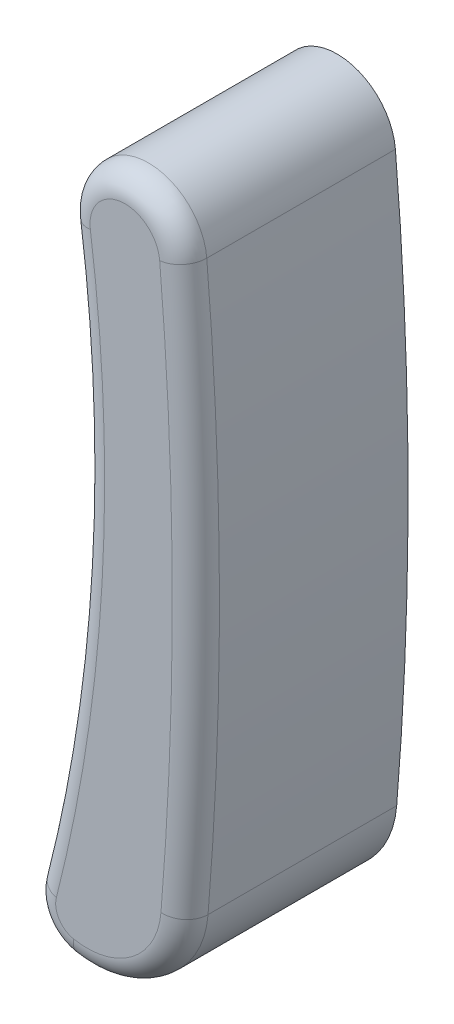
ISO-10303-21;
HEADER;
FILE_DESCRIPTION(('STEP AP214'),'2;1');
FILE_NAME('part.step','',(''),(''),'','','');
FILE_SCHEMA(('AUTOMOTIVE_DESIGN { 1 0 10303 214 1 1 1 1 }'));
ENDSEC;
DATA;
#1=APPLICATION_CONTEXT('core data for automotive mechanical design processes');
#2=APPLICATION_PROTOCOL_DEFINITION('international standard','automotive_design',2000,#1);
#3=PRODUCT_CONTEXT('',#1,'mechanical');
#4=PRODUCT('Part','Part','',(#3));
#5=PRODUCT_RELATED_PRODUCT_CATEGORY('part','',(#4));
#6=PRODUCT_DEFINITION_FORMATION('','',#4);
#7=PRODUCT_DEFINITION_CONTEXT('part definition',#1,'design');
#8=PRODUCT_DEFINITION('design','',#6,#7);
#9=PRODUCT_DEFINITION_SHAPE('','',#8);
#10=(LENGTH_UNIT() NAMED_UNIT(*) SI_UNIT(.MILLI.,.METRE.));
#11=(NAMED_UNIT(*) PLANE_ANGLE_UNIT() SI_UNIT($,.RADIAN.));
#12=(NAMED_UNIT(*) SI_UNIT($,.STERADIAN.) SOLID_ANGLE_UNIT());
#13=UNCERTAINTY_MEASURE_WITH_UNIT(LENGTH_MEASURE(1.E-05),#10,'distance_accuracy_value','');
#14=(GEOMETRIC_REPRESENTATION_CONTEXT(3) GLOBAL_UNCERTAINTY_ASSIGNED_CONTEXT((#13)) GLOBAL_UNIT_ASSIGNED_CONTEXT((#10,
#11,#12)) REPRESENTATION_CONTEXT('',''));
#15=CARTESIAN_POINT('',(0.,0.,0.));
#16=DIRECTION('',(0.,0.,1.));
#17=DIRECTION('',(1.,0.,0.));
#18=AXIS2_PLACEMENT_3D('',#15,#16,#17);
#19=CARTESIAN_POINT('',(-69.4737555962124,0.222065170422888,4.5));
#20=DIRECTION('',(0.,0.,-1.));
#21=DIRECTION('',(-1.,0.,0.));
#22=AXIS2_PLACEMENT_3D('',#19,#20,#21);
#23=CYLINDRICAL_SURFACE('',#22,71.2102253998222);
#24=DIRECTION('',(0.,0.,-1.));
#25=VECTOR('',#24,1.);
#26=CARTESIAN_POINT('',(1.46761875852094,6.40410416698838,4.5));
#27=LINE('',#26,#25);
#28=CARTESIAN_POINT('',(1.46761875852094,6.40410416698838,4.));
#29=VERTEX_POINT('',#28);
#30=CARTESIAN_POINT('',(1.46761875852094,6.40410416698838,0.));
#31=VERTEX_POINT('',#30);
#32=EDGE_CURVE('E100',#29,#31,#27,.T.);
#33=ORIENTED_EDGE('',*,*,#32,.F.);
#34=CARTESIAN_POINT('',(-69.4737555962124,0.222065170422888,4.));
#35=DIRECTION('',(0.,0.,1.));
#36=DIRECTION('',(1.,0.,0.));
#37=AXIS2_PLACEMENT_3D('',#34,#35,#36);
#38=CIRCLE('',#37,71.2102253998222);
#39=CARTESIAN_POINT('',(1.49502237075019,-5.63700944673482,4.));
#40=VERTEX_POINT('',#39);
#41=EDGE_CURVE('E11',#29,#40,#38,.F.);
#42=ORIENTED_EDGE('',*,*,#41,.T.);
#43=DIRECTION('',(0.,0.,-1.));
#44=VECTOR('',#43,1.);
#45=CARTESIAN_POINT('',(1.49502237075019,-5.63700944673482,4.5));
#46=LINE('',#45,#44);
#47=CARTESIAN_POINT('',(1.49502237075019,-5.63700944673482,0.));
#48=VERTEX_POINT('',#47);
#49=EDGE_CURVE('E121',#40,#48,#46,.T.);
#50=ORIENTED_EDGE('',*,*,#49,.T.);
#51=CARTESIAN_POINT('',(-69.4737555962124,0.222065170422888,0.));
#52=DIRECTION('',(0.,0.,1.));
#53=DIRECTION('',(1.,0.,0.));
#54=AXIS2_PLACEMENT_3D('',#51,#52,#53);
#55=CIRCLE('',#54,71.2102253998222);
#56=EDGE_CURVE('E115',#48,#31,#55,.T.);
#57=ORIENTED_EDGE('',*,*,#56,.T.);
#58=EDGE_LOOP('',(#33,#42,#50,#57));
#59=FACE_BOUND('',#58,.T.);
#60=ADVANCED_FACE('F39',(#59),#23,.T.);
#61=CARTESIAN_POINT('',(0.232087765483922,6.29643638003197,4.5));
#62=DIRECTION('',(0.,0.,-1.));
#63=DIRECTION('',(-1.,0.,0.));
#64=AXIS2_PLACEMENT_3D('',#61,#62,#63);
#65=CYLINDRICAL_SURFACE('',#64,1.24021336353997);
#66=DIRECTION('',(0.,0.,-1.));
#67=VECTOR('',#66,1.);
#68=CARTESIAN_POINT('',(-0.996737871420484,6.12875590654262,4.5));
#69=LINE('',#68,#67);
#70=CARTESIAN_POINT('',(-0.996737871420484,6.12875590654262,4.));
#71=VERTEX_POINT('',#70);
#72=CARTESIAN_POINT('',(-0.996737871420484,6.12875590654262,0.));
#73=VERTEX_POINT('',#72);
#74=EDGE_CURVE('E109',#71,#73,#69,.T.);
#75=ORIENTED_EDGE('',*,*,#74,.F.);
#76=CARTESIAN_POINT('',(0.232087765483922,6.29643638003197,4.));
#77=DIRECTION('',(0.,0.,1.));
#78=DIRECTION('',(1.,0.,0.));
#79=AXIS2_PLACEMENT_3D('',#76,#77,#78);
#80=CIRCLE('',#79,1.24021336353997);
#81=EDGE_CURVE('E48',#71,#29,#80,.F.);
#82=ORIENTED_EDGE('',*,*,#81,.T.);
#83=ORIENTED_EDGE('',*,*,#32,.T.);
#84=CARTESIAN_POINT('',(0.232087765483922,6.29643638003197,0.));
#85=DIRECTION('',(0.,0.,1.));
#86=DIRECTION('',(1.,0.,0.));
#87=AXIS2_PLACEMENT_3D('',#84,#85,#86);
#88=CIRCLE('',#87,1.24021336353997);
#89=EDGE_CURVE('E103',#31,#73,#88,.T.);
#90=ORIENTED_EDGE('',*,*,#89,.T.);
#91=EDGE_LOOP('',(#75,#82,#83,#90));
#92=FACE_BOUND('',#91,.T.);
#93=ADVANCED_FACE('F102',(#92),#65,.T.);
#94=CARTESIAN_POINT('',(-33.2472226070941,1.72798789811171,4.5));
#95=DIRECTION('',(0.,0.,-1.));
#96=DIRECTION('',(-1.,0.,0.));
#97=AXIS2_PLACEMENT_3D('',#94,#95,#96);
#98=CYLINDRICAL_SURFACE('',#97,32.5493552125069);
#99=DIRECTION('',(0.,0.,-1.));
#100=VECTOR('',#99,1.);
#101=CARTESIAN_POINT('',(-1.70650206276595,-6.31212853727334,4.5));
#102=LINE('',#101,#100);
#103=CARTESIAN_POINT('',(-1.70650206276595,-6.31212853727334,4.));
#104=VERTEX_POINT('',#103);
#105=CARTESIAN_POINT('',(-1.70650206276595,-6.31212853727334,0.));
#106=VERTEX_POINT('',#105);
#107=EDGE_CURVE('E136',#104,#106,#102,.T.);
#108=ORIENTED_EDGE('',*,*,#107,.F.);
#109=CARTESIAN_POINT('',(-33.2472226070941,1.72798789811171,4.));
#110=DIRECTION('',(0.,0.,1.));
#111=DIRECTION('',(1.,0.,0.));
#112=AXIS2_PLACEMENT_3D('',#109,#110,#111);
#113=CIRCLE('',#112,32.5493552125069);
#114=EDGE_CURVE('E63',#104,#71,#113,.T.);
#115=ORIENTED_EDGE('',*,*,#114,.T.);
#116=ORIENTED_EDGE('',*,*,#74,.T.);
#117=CARTESIAN_POINT('',(-33.2472226070941,1.72798789811171,0.));
#118=DIRECTION('',(0.,0.,-1.));
#119=DIRECTION('',(1.,0.,0.));
#120=AXIS2_PLACEMENT_3D('',#117,#118,#119);
#121=CIRCLE('',#120,32.5493552125069);
#122=EDGE_CURVE('E118',#73,#106,#121,.T.);
#123=ORIENTED_EDGE('',*,*,#122,.T.);
#124=EDGE_LOOP('',(#108,#115,#116,#123));
#125=FACE_BOUND('',#124,.T.);
#126=ADVANCED_FACE('F204',(#125),#98,.F.);
#127=CARTESIAN_POINT('',(-0.769389578810673,-6.55101000079193,4.5));
#128=DIRECTION('',(0.,0.,-1.));
#129=DIRECTION('',(-1.,0.,0.));
#130=AXIS2_PLACEMENT_3D('',#127,#128,#129);
#131=CYLINDRICAL_SURFACE('',#130,0.967080224799222);
#132=DIRECTION('',(0.,0.,-1.));
#133=VECTOR('',#132,1.);
#134=CARTESIAN_POINT('',(-0.946059772700119,-7.50181587150833,4.5));
#135=LINE('',#134,#133);
#136=CARTESIAN_POINT('',(-0.946059772700119,-7.50181587150833,4.));
#137=VERTEX_POINT('',#136);
#138=CARTESIAN_POINT('',(-0.946059772700119,-7.50181587150833,0.));
#139=VERTEX_POINT('',#138);
#140=EDGE_CURVE('E134',#137,#139,#135,.T.);
#141=ORIENTED_EDGE('',*,*,#140,.F.);
#142=CARTESIAN_POINT('',(-0.769389578810673,-6.55101000079193,4.));
#143=DIRECTION('',(0.,0.,1.));
#144=DIRECTION('',(1.,0.,0.));
#145=AXIS2_PLACEMENT_3D('',#142,#143,#144);
#146=CIRCLE('',#145,0.967080224799222);
#147=EDGE_CURVE('E152',#137,#104,#146,.F.);
#148=ORIENTED_EDGE('',*,*,#147,.T.);
#149=ORIENTED_EDGE('',*,*,#107,.T.);
#150=CARTESIAN_POINT('',(-0.769389578810673,-6.55101000079193,0.));
#151=DIRECTION('',(0.,0.,1.));
#152=DIRECTION('',(1.,0.,0.));
#153=AXIS2_PLACEMENT_3D('',#150,#151,#152);
#154=CIRCLE('',#153,0.967080224799222);
#155=EDGE_CURVE('E128',#106,#139,#154,.T.);
#156=ORIENTED_EDGE('',*,*,#155,.T.);
#157=EDGE_LOOP('',(#141,#148,#149,#156));
#158=FACE_BOUND('',#157,.T.);
#159=ADVANCED_FACE('F197',(#158),#131,.T.);
#160=CARTESIAN_POINT('',(-0.567912234516366,-5.46669669613084,4.5));
#161=DIRECTION('',(0.,0.,-1.));
#162=DIRECTION('',(-1.,0.,0.));
#163=AXIS2_PLACEMENT_3D('',#160,#161,#162);
#164=CYLINDRICAL_SURFACE('',#163,2.06995304744445);
#165=ORIENTED_EDGE('',*,*,#49,.F.);
#166=CARTESIAN_POINT('',(-0.567912234516366,-5.46669669613084,4.));
#167=DIRECTION('',(0.,0.,1.));
#168=DIRECTION('',(1.,0.,0.));
#169=AXIS2_PLACEMENT_3D('',#166,#167,#168);
#170=CIRCLE('',#169,2.06995304744445);
#171=EDGE_CURVE('E149',#40,#137,#170,.F.);
#172=ORIENTED_EDGE('',*,*,#171,.T.);
#173=ORIENTED_EDGE('',*,*,#140,.T.);
#174=CARTESIAN_POINT('',(-0.567912234516366,-5.46669669613084,0.));
#175=DIRECTION('',(0.,0.,1.));
#176=DIRECTION('',(1.,0.,0.));
#177=AXIS2_PLACEMENT_3D('',#174,#175,#176);
#178=CIRCLE('',#177,2.06995304744445);
#179=EDGE_CURVE('E131',#139,#48,#178,.T.);
#180=ORIENTED_EDGE('',*,*,#179,.T.);
#181=EDGE_LOOP('',(#165,#172,#173,#180));
#182=FACE_BOUND('',#181,.T.);
#183=ADVANCED_FACE('F182',(#182),#164,.T.);
#184=CARTESIAN_POINT('',(-34.6208339153643,3.25925077522743,4.5));
#185=DIRECTION('',(0.,0.,1.));
#186=DIRECTION('',(1.,0.,0.));
#187=AXIS2_PLACEMENT_3D('',#184,#185,#186);
#188=PLANE('',#187);
#189=CARTESIAN_POINT('',(-0.769389578810673,-6.55101000079193,4.5));
#190=DIRECTION('',(0.,0.,1.));
#191=DIRECTION('',(1.,0.,0.));
#192=AXIS2_PLACEMENT_3D('',#189,#190,#191);
#193=CIRCLE('',#192,0.467080224799222);
#194=CARTESIAN_POINT('',(-1.22199598978225,-6.43563507654116,4.5));
#195=VERTEX_POINT('',#194);
#196=CARTESIAN_POINT('',(-0.854717715775047,-7.01023004112192,4.5));
#197=VERTEX_POINT('',#196);
#198=EDGE_CURVE('E144',#195,#197,#193,.T.);
#199=ORIENTED_EDGE('',*,*,#198,.T.);
#200=CARTESIAN_POINT('',(-0.567912234516366,-5.46669669613084,4.5));
#201=DIRECTION('',(0.,0.,1.));
#202=DIRECTION('',(1.,0.,0.));
#203=AXIS2_PLACEMENT_3D('',#200,#201,#202);
#204=CIRCLE('',#203,1.56995304744445);
#205=CARTESIAN_POINT('',(0.996717685092511,-5.59587016804099,4.5));
#206=VERTEX_POINT('',#205);
#207=EDGE_CURVE('E146',#197,#206,#204,.T.);
#208=ORIENTED_EDGE('',*,*,#207,.T.);
#209=CARTESIAN_POINT('',(-69.4737555962124,0.222065170422888,4.5));
#210=DIRECTION('',(0.,0.,1.));
#211=DIRECTION('',(1.,0.,0.));
#212=AXIS2_PLACEMENT_3D('',#209,#210,#211);
#213=CIRCLE('',#212,70.7102253998222);
#214=CARTESIAN_POINT('',(0.96950648632678,6.36069720568573,4.5));
#215=VERTEX_POINT('',#214);
#216=EDGE_CURVE('E108',#206,#215,#213,.T.);
#217=ORIENTED_EDGE('',*,*,#216,.T.);
#218=CARTESIAN_POINT('',(0.232087765483922,6.29643638003197,4.5));
#219=DIRECTION('',(0.,0.,1.));
#220=DIRECTION('',(1.,0.,0.));
#221=AXIS2_PLACEMENT_3D('',#218,#219,#220);
#222=CIRCLE('',#221,0.740213363539972);
#223=CARTESIAN_POINT('',(-0.501328906709539,6.19635736868679,4.5));
#224=VERTEX_POINT('',#223);
#225=EDGE_CURVE('E140',#215,#224,#222,.T.);
#226=ORIENTED_EDGE('',*,*,#225,.T.);
#227=CARTESIAN_POINT('',(-33.2472226070941,1.72798789811171,4.5));
#228=DIRECTION('',(0.,0.,1.));
#229=DIRECTION('',(1.,0.,0.));
#230=AXIS2_PLACEMENT_3D('',#227,#228,#229);
#231=CIRCLE('',#230,33.0493552125069);
#232=EDGE_CURVE('E142',#224,#195,#231,.F.);
#233=ORIENTED_EDGE('',*,*,#232,.T.);
#234=EDGE_LOOP('',(#199,#208,#217,#226,#233));
#235=FACE_BOUND('',#234,.T.);
#236=ADVANCED_FACE('F188',(#235),#188,.T.);
#237=CARTESIAN_POINT('',(-34.6208339153643,3.25925077522743,0.));
#238=DIRECTION('',(0.,0.,1.));
#239=DIRECTION('',(1.,0.,0.));
#240=AXIS2_PLACEMENT_3D('',#237,#238,#239);
#241=PLANE('',#240);
#242=ORIENTED_EDGE('',*,*,#56,.F.);
#243=ORIENTED_EDGE('',*,*,#179,.F.);
#244=ORIENTED_EDGE('',*,*,#155,.F.);
#245=ORIENTED_EDGE('',*,*,#122,.F.);
#246=ORIENTED_EDGE('',*,*,#89,.F.);
#247=EDGE_LOOP('',(#242,#243,#244,#245,#246));
#248=FACE_BOUND('',#247,.T.);
#249=ADVANCED_FACE('F113',(#248),#241,.F.);
#250=CARTESIAN_POINT('',(-33.2472226070941,1.72798789811171,4.));
#251=DIRECTION('',(0.,0.,1.));
#252=DIRECTION('',(1.,0.,0.));
#253=AXIS2_PLACEMENT_3D('',#250,#251,#252);
#254=TOROIDAL_SURFACE('',#253,33.0493552125069,0.5);
#255=CARTESIAN_POINT('',(-1.22199598978225,-6.43563507654116,4.));
#256=DIRECTION('',(-0.247013078535648,-0.969012145967398,0.));
#257=DIRECTION('',(0.969012145967398,-0.247013078535648,0.));
#258=AXIS2_PLACEMENT_3D('',#255,#256,#257);
#259=CIRCLE('',#258,0.5);
#260=EDGE_CURVE('E125',#195,#104,#259,.T.);
#261=ORIENTED_EDGE('',*,*,#260,.F.);
#262=ORIENTED_EDGE('',*,*,#232,.F.);
#263=CARTESIAN_POINT('',(-0.501328906709436,6.1963573686868,4.));
#264=DIRECTION('',(-0.135202924288341,0.99081792942189,0.));
#265=DIRECTION('',(-0.99081792942189,-0.135202924288341,0.));
#266=AXIS2_PLACEMENT_3D('',#263,#264,#265);
#267=CIRCLE('',#266,0.5);
#268=EDGE_CURVE('E43',#71,#224,#267,.T.);
#269=ORIENTED_EDGE('',*,*,#268,.F.);
#270=ORIENTED_EDGE('',*,*,#114,.F.);
#271=EDGE_LOOP('',(#261,#262,#269,#270));
#272=FACE_BOUND('',#271,.T.);
#273=ADVANCED_FACE('F41',(#272),#254,.T.);
#274=CARTESIAN_POINT('',(0.232087765483922,6.29643638003197,4.));
#275=DIRECTION('',(0.,0.,1.));
#276=DIRECTION('',(1.,0.,0.));
#277=AXIS2_PLACEMENT_3D('',#274,#275,#276);
#278=TOROIDAL_SURFACE('',#277,0.740213363539972,0.5);
#279=ORIENTED_EDGE('',*,*,#268,.T.);
#280=ORIENTED_EDGE('',*,*,#225,.F.);
#281=CARTESIAN_POINT('',(0.969506486326738,6.36069720568573,4.));
#282=DIRECTION('',(0.0868139226052923,-0.996224544388404,0.));
#283=DIRECTION('',(0.996224544388404,0.0868139226052923,0.));
#284=AXIS2_PLACEMENT_3D('',#281,#282,#283);
#285=CIRCLE('',#284,0.5);
#286=EDGE_CURVE('E160',#29,#215,#285,.T.);
#287=ORIENTED_EDGE('',*,*,#286,.F.);
#288=ORIENTED_EDGE('',*,*,#81,.F.);
#289=EDGE_LOOP('',(#279,#280,#287,#288));
#290=FACE_BOUND('',#289,.T.);
#291=ADVANCED_FACE('F174',(#290),#278,.T.);
#292=CARTESIAN_POINT('',(-0.769389578810673,-6.55101000079193,4.));
#293=DIRECTION('',(0.,0.,1.));
#294=DIRECTION('',(1.,0.,0.));
#295=AXIS2_PLACEMENT_3D('',#292,#293,#294);
#296=DEGENERATE_TOROIDAL_SURFACE('',#295,0.467080224799222,0.5,.T.);
#297=ORIENTED_EDGE('',*,*,#260,.T.);
#298=ORIENTED_EDGE('',*,*,#147,.F.);
#299=CARTESIAN_POINT('',(-0.854717715775047,-7.01023004112192,4.));
#300=DIRECTION('',(0.983171660772821,-0.182684113850145,0.));
#301=DIRECTION('',(0.182684113850145,0.983171660772821,0.));
#302=AXIS2_PLACEMENT_3D('',#299,#300,#301);
#303=CIRCLE('',#302,0.5);
#304=EDGE_CURVE('E158',#197,#137,#303,.T.);
#305=ORIENTED_EDGE('',*,*,#304,.F.);
#306=ORIENTED_EDGE('',*,*,#198,.F.);
#307=EDGE_LOOP('',(#297,#298,#305,#306));
#308=FACE_BOUND('',#307,.T.);
#309=ADVANCED_FACE('F167',(#308),#296,.T.);
#310=CARTESIAN_POINT('',(-69.4737555962124,0.222065170422888,4.));
#311=DIRECTION('',(0.,0.,1.));
#312=DIRECTION('',(1.,0.,0.));
#313=AXIS2_PLACEMENT_3D('',#310,#311,#312);
#314=TOROIDAL_SURFACE('',#313,70.7102253998222,0.5);
#315=ORIENTED_EDGE('',*,*,#286,.T.);
#316=ORIENTED_EDGE('',*,*,#216,.F.);
#317=CARTESIAN_POINT('',(0.996717685092516,-5.59587016804093,4.));
#318=DIRECTION('',(-0.0822785573878042,-0.996609371315653,-1.18381934384536E-13));
#319=DIRECTION('',(0.996609371315653,-0.0822785573878042,0.));
#320=AXIS2_PLACEMENT_3D('',#317,#318,#319);
#321=CIRCLE('',#320,0.5);
#322=EDGE_CURVE('E156',#40,#206,#321,.T.);
#323=ORIENTED_EDGE('',*,*,#322,.F.);
#324=ORIENTED_EDGE('',*,*,#41,.F.);
#325=EDGE_LOOP('',(#315,#316,#323,#324));
#326=FACE_BOUND('',#325,.T.);
#327=ADVANCED_FACE('F179',(#326),#314,.T.);
#328=CARTESIAN_POINT('',(-0.567912234516366,-5.46669669613084,4.));
#329=DIRECTION('',(0.,0.,1.));
#330=DIRECTION('',(1.,0.,0.));
#331=AXIS2_PLACEMENT_3D('',#328,#329,#330);
#332=TOROIDAL_SURFACE('',#331,1.56995304744445,0.5);
#333=ORIENTED_EDGE('',*,*,#304,.T.);
#334=ORIENTED_EDGE('',*,*,#171,.F.);
#335=ORIENTED_EDGE('',*,*,#322,.T.);
#336=ORIENTED_EDGE('',*,*,#207,.F.);
#337=EDGE_LOOP('',(#333,#334,#335,#336));
#338=FACE_BOUND('',#337,.T.);
#339=ADVANCED_FACE('F185',(#338),#332,.T.);
#340=CLOSED_SHELL('',(#60,#93,#126,#159,#183,#236,#249,#273,#291,#309,#327,#339));
#341=MANIFOLD_SOLID_BREP('B2',#340);
#342=ADVANCED_BREP_SHAPE_REPRESENTATION('',(#18,#341),#14);
#343=SHAPE_DEFINITION_REPRESENTATION(#9,#342);
ENDSEC;
END-ISO-10303-21;
